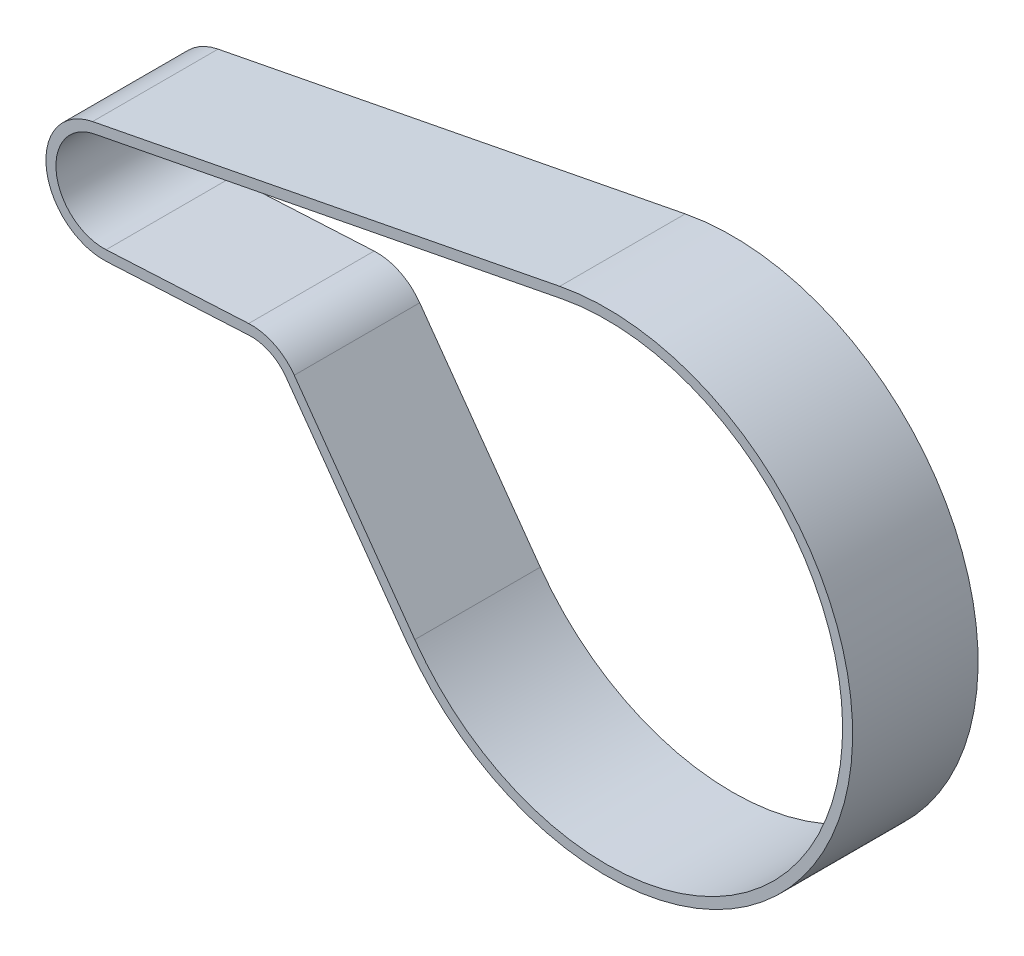
ISO-10303-21;
HEADER;
FILE_DESCRIPTION(('STEP AP214'),'2;1');
FILE_NAME('part.step','',(''),(''),'','','');
FILE_SCHEMA(('AUTOMOTIVE_DESIGN { 1 0 10303 214 1 1 1 1 }'));
ENDSEC;
DATA;
#1=APPLICATION_CONTEXT('core data for automotive mechanical design processes');
#2=APPLICATION_PROTOCOL_DEFINITION('international standard','automotive_design',2000,#1);
#3=PRODUCT_CONTEXT('',#1,'mechanical');
#4=PRODUCT('Part','Part','',(#3));
#5=PRODUCT_RELATED_PRODUCT_CATEGORY('part','',(#4));
#6=PRODUCT_DEFINITION_FORMATION('','',#4);
#7=PRODUCT_DEFINITION_CONTEXT('part definition',#1,'design');
#8=PRODUCT_DEFINITION('design','',#6,#7);
#9=PRODUCT_DEFINITION_SHAPE('','',#8);
#10=(LENGTH_UNIT() NAMED_UNIT(*) SI_UNIT(.MILLI.,.METRE.));
#11=(NAMED_UNIT(*) PLANE_ANGLE_UNIT() SI_UNIT($,.RADIAN.));
#12=(NAMED_UNIT(*) SI_UNIT($,.STERADIAN.) SOLID_ANGLE_UNIT());
#13=UNCERTAINTY_MEASURE_WITH_UNIT(LENGTH_MEASURE(1.E-05),#10,'distance_accuracy_value','');
#14=(GEOMETRIC_REPRESENTATION_CONTEXT(3) GLOBAL_UNCERTAINTY_ASSIGNED_CONTEXT((#13)) GLOBAL_UNIT_ASSIGNED_CONTEXT((#10,
#11,#12)) REPRESENTATION_CONTEXT('',''));
#15=CARTESIAN_POINT('',(0.,0.,0.));
#16=DIRECTION('',(0.,0.,1.));
#17=DIRECTION('',(1.,0.,0.));
#18=AXIS2_PLACEMENT_3D('',#15,#16,#17);
#19=CARTESIAN_POINT('',(-8.75410854916936E-11,-1.35003119794419E-10,-9.5));
#20=DIRECTION('',(0.,0.,1.));
#21=DIRECTION('',(1.,0.,0.));
#22=AXIS2_PLACEMENT_3D('',#19,#20,#21);
#23=CYLINDRICAL_SURFACE('',#22,11.5);
#24=DIRECTION('',(0.,0.,1.));
#25=VECTOR('',#24,1.);
#26=CARTESIAN_POINT('',(0.595527740548142,-11.4845699402822,-9.5));
#27=LINE('',#26,#25);
#28=CARTESIAN_POINT('',(0.595527740548142,-11.4845699402822,-9.5));
#29=VERTEX_POINT('',#28);
#30=CARTESIAN_POINT('',(0.595527740548142,-11.4845699402822,15.5));
#31=VERTEX_POINT('',#30);
#32=EDGE_CURVE('E108',#29,#31,#27,.T.);
#33=ORIENTED_EDGE('',*,*,#32,.T.);
#34=CARTESIAN_POINT('',(-8.75410854916936E-11,-1.35003119794419E-10,15.5));
#35=DIRECTION('',(0.,0.,-1.));
#36=DIRECTION('',(-1.,0.,0.));
#37=AXIS2_PLACEMENT_3D('',#34,#35,#36);
#38=CIRCLE('',#37,11.5);
#39=CARTESIAN_POINT('',(-2.19608532579702,11.2883661013964,15.5));
#40=VERTEX_POINT('',#39);
#41=EDGE_CURVE('E231',#40,#31,#38,.F.);
#42=ORIENTED_EDGE('',*,*,#41,.F.);
#43=DIRECTION('',(0.,0.,1.));
#44=VECTOR('',#43,1.);
#45=CARTESIAN_POINT('',(-2.19608532579702,11.2883661013964,-9.5));
#46=LINE('',#45,#44);
#47=CARTESIAN_POINT('',(-2.19608532579702,11.2883661013964,-9.5));
#48=VERTEX_POINT('',#47);
#49=EDGE_CURVE('E12',#48,#40,#46,.T.);
#50=ORIENTED_EDGE('',*,*,#49,.F.);
#51=CARTESIAN_POINT('',(-8.75410854916936E-11,-1.35003119794419E-10,-9.5));
#52=DIRECTION('',(0.,0.,-1.));
#53=DIRECTION('',(-1.,0.,0.));
#54=AXIS2_PLACEMENT_3D('',#51,#52,#53);
#55=CIRCLE('',#54,11.5);
#56=EDGE_CURVE('E262',#48,#29,#55,.F.);
#57=ORIENTED_EDGE('',*,*,#56,.T.);
#58=EDGE_LOOP('',(#33,#42,#50,#57));
#59=FACE_BOUND('',#58,.T.);
#60=ADVANCED_FACE('F105',(#59),#23,.T.);
#61=CARTESIAN_POINT('',(-2.19608532579702,11.2883661013964,-9.5));
#62=DIRECTION('',(-0.190963941366042,0.981597052307079,0.));
#63=DIRECTION('',(-0.981597052307079,-0.190963941366042,0.));
#64=AXIS2_PLACEMENT_3D('',#61,#62,#63);
#65=PLANE('',#64);
#66=ORIENTED_EDGE('',*,*,#49,.T.);
#67=DIRECTION('',(-0.981597052307079,-0.190963941366042,0.));
#68=VECTOR('',#67,1.);
#69=CARTESIAN_POINT('',(-2.19608532579702,11.2883661013964,15.5));
#70=LINE('',#69,#68);
#71=CARTESIAN_POINT('',(90.8927668730152,29.3982555630091,15.5));
#72=VERTEX_POINT('',#71);
#73=EDGE_CURVE('E246',#72,#40,#70,.T.);
#74=ORIENTED_EDGE('',*,*,#73,.F.);
#75=DIRECTION('',(0.,0.,1.));
#76=VECTOR('',#75,1.);
#77=CARTESIAN_POINT('',(90.8927668730152,29.3982555630091,-9.5));
#78=LINE('',#77,#76);
#79=CARTESIAN_POINT('',(90.8927668730152,29.3982555630091,-9.5));
#80=VERTEX_POINT('',#79);
#81=EDGE_CURVE('E113',#80,#72,#78,.T.);
#82=ORIENTED_EDGE('',*,*,#81,.F.);
#83=DIRECTION('',(-0.981597052307079,-0.190963941366042,0.));
#84=VECTOR('',#83,1.);
#85=CARTESIAN_POINT('',(-2.19608532579702,11.2883661013964,-9.5));
#86=LINE('',#85,#84);
#87=EDGE_CURVE('E283',#80,#48,#86,.T.);
#88=ORIENTED_EDGE('',*,*,#87,.T.);
#89=EDGE_LOOP('',(#66,#74,#82,#88));
#90=FACE_BOUND('',#89,.T.);
#91=ADVANCED_FACE('F300',(#90),#65,.T.);
#92=CARTESIAN_POINT('',(100.249999999951,-18.7000000000378,-9.5));
#93=DIRECTION('',(0.,0.,1.));
#94=DIRECTION('',(1.,0.,0.));
#95=AXIS2_PLACEMENT_3D('',#92,#93,#94);
#96=CYLINDRICAL_SURFACE('',#95,49.);
#97=ORIENTED_EDGE('',*,*,#81,.T.);
#98=CARTESIAN_POINT('',(100.249999999951,-18.7000000000378,15.5));
#99=DIRECTION('',(0.,0.,-1.));
#100=DIRECTION('',(-1.,0.,0.));
#101=AXIS2_PLACEMENT_3D('',#98,#99,#100);
#102=CIRCLE('',#101,49.);
#103=CARTESIAN_POINT('',(60.3770303060087,-47.1806300454904,15.5));
#104=VERTEX_POINT('',#103);
#105=EDGE_CURVE('E243',#104,#72,#102,.F.);
#106=ORIENTED_EDGE('',*,*,#105,.F.);
#107=DIRECTION('',(0.,0.,1.));
#108=VECTOR('',#107,1.);
#109=CARTESIAN_POINT('',(60.3770303060087,-47.1806300454904,-9.5));
#110=LINE('',#109,#108);
#111=CARTESIAN_POINT('',(60.3770303060087,-47.1806300454904,-9.5));
#112=VERTEX_POINT('',#111);
#113=EDGE_CURVE('E287',#112,#104,#110,.T.);
#114=ORIENTED_EDGE('',*,*,#113,.F.);
#115=CARTESIAN_POINT('',(100.249999999951,-18.7000000000378,-9.5));
#116=DIRECTION('',(0.,0.,-1.));
#117=DIRECTION('',(-1.,0.,0.));
#118=AXIS2_PLACEMENT_3D('',#115,#116,#117);
#119=CIRCLE('',#118,49.);
#120=EDGE_CURVE('E280',#112,#80,#119,.F.);
#121=ORIENTED_EDGE('',*,*,#120,.T.);
#122=EDGE_LOOP('',(#97,#106,#114,#121));
#123=FACE_BOUND('',#122,.T.);
#124=ADVANCED_FACE('F313',(#123),#96,.T.);
#125=CARTESIAN_POINT('',(17.6642973466046,12.6173275178712,-9.5));
#126=DIRECTION('',(-0.813734075386583,-0.58123734786638,0.));
#127=DIRECTION('',(0.58123734786638,-0.813734075386583,0.));
#128=AXIS2_PLACEMENT_3D('',#125,#126,#127);
#129=PLANE('',#128);
#130=ORIENTED_EDGE('',*,*,#113,.T.);
#131=DIRECTION('',(0.58123734786638,-0.813734075386583,0.));
#132=VECTOR('',#131,1.);
#133=CARTESIAN_POINT('',(17.6642973466046,12.6173275178712,15.5));
#134=LINE('',#133,#132);
#135=CARTESIAN_POINT('',(36.3619777260362,-13.5594825430823,15.5));
#136=VERTEX_POINT('',#135);
#137=EDGE_CURVE('E240',#136,#104,#134,.T.);
#138=ORIENTED_EDGE('',*,*,#137,.F.);
#139=DIRECTION('',(0.,0.,1.));
#140=VECTOR('',#139,1.);
#141=CARTESIAN_POINT('',(36.3619777260362,-13.5594825430823,-9.5));
#142=LINE('',#141,#140);
#143=CARTESIAN_POINT('',(36.3619777260362,-13.5594825430823,-9.5));
#144=VERTEX_POINT('',#143);
#145=EDGE_CURVE('E289',#144,#136,#142,.T.);
#146=ORIENTED_EDGE('',*,*,#145,.F.);
#147=DIRECTION('',(0.58123734786638,-0.813734075386583,0.));
#148=VECTOR('',#147,1.);
#149=CARTESIAN_POINT('',(17.6642973466046,12.6173275178712,-9.5));
#150=LINE('',#149,#148);
#151=EDGE_CURVE('E277',#144,#112,#150,.T.);
#152=ORIENTED_EDGE('',*,*,#151,.T.);
#153=EDGE_LOOP('',(#130,#138,#146,#152));
#154=FACE_BOUND('',#153,.T.);
#155=ADVANCED_FACE('F311',(#154),#129,.T.);
#156=CARTESIAN_POINT('',(29.4452380852502,-18.4999999999465,-9.5));
#157=DIRECTION('',(0.,0.,1.));
#158=DIRECTION('',(1.,0.,0.));
#159=AXIS2_PLACEMENT_3D('',#156,#157,#158);
#160=CYLINDRICAL_SURFACE('',#159,8.5);
#161=ORIENTED_EDGE('',*,*,#145,.T.);
#162=CARTESIAN_POINT('',(29.4452380852502,-18.4999999999465,15.5));
#163=DIRECTION('',(0.,0.,-1.));
#164=DIRECTION('',(-1.,0.,0.));
#165=AXIS2_PLACEMENT_3D('',#162,#163,#164);
#166=CIRCLE('',#165,8.5);
#167=CARTESIAN_POINT('',(29.0050654073891,-10.0114048267942,15.5));
#168=VERTEX_POINT('',#167);
#169=EDGE_CURVE('E237',#168,#136,#166,.T.);
#170=ORIENTED_EDGE('',*,*,#169,.F.);
#171=DIRECTION('',(0.,0.,1.));
#172=VECTOR('',#171,1.);
#173=CARTESIAN_POINT('',(29.0050654073891,-10.0114048267942,-9.5));
#174=LINE('',#173,#172);
#175=CARTESIAN_POINT('',(29.0050654073891,-10.0114048267942,-9.5));
#176=VERTEX_POINT('',#175);
#177=EDGE_CURVE('E290',#176,#168,#174,.T.);
#178=ORIENTED_EDGE('',*,*,#177,.F.);
#179=CARTESIAN_POINT('',(29.4452380852502,-18.4999999999465,-9.5));
#180=DIRECTION('',(0.,0.,-1.));
#181=DIRECTION('',(-1.,0.,0.));
#182=AXIS2_PLACEMENT_3D('',#179,#180,#181);
#183=CIRCLE('',#182,8.5);
#184=EDGE_CURVE('E274',#176,#144,#183,.T.);
#185=ORIENTED_EDGE('',*,*,#184,.T.);
#186=EDGE_LOOP('',(#161,#170,#178,#185));
#187=FACE_BOUND('',#186,.T.);
#188=ADVANCED_FACE('F308',(#187),#160,.F.);
#189=CARTESIAN_POINT('',(0.595527740548146,-11.4845699402822,-9.5));
#190=DIRECTION('',(0.0517850209248424,-0.998658255664977,0.));
#191=DIRECTION('',(0.998658255664977,0.0517850209248424,0.));
#192=AXIS2_PLACEMENT_3D('',#189,#190,#191);
#193=PLANE('',#192);
#194=ORIENTED_EDGE('',*,*,#177,.T.);
#195=DIRECTION('',(0.998658255664977,0.0517850209248424,0.));
#196=VECTOR('',#195,1.);
#197=CARTESIAN_POINT('',(0.595527740548146,-11.4845699402822,15.5));
#198=LINE('',#197,#196);
#199=EDGE_CURVE('E234',#31,#168,#198,.T.);
#200=ORIENTED_EDGE('',*,*,#199,.F.);
#201=ORIENTED_EDGE('',*,*,#32,.F.);
#202=DIRECTION('',(0.998658255664977,0.0517850209248424,0.));
#203=VECTOR('',#202,1.);
#204=CARTESIAN_POINT('',(0.595527740548146,-11.4845699402822,-9.5));
#205=LINE('',#204,#203);
#206=EDGE_CURVE('E271',#29,#176,#205,.T.);
#207=ORIENTED_EDGE('',*,*,#206,.T.);
#208=EDGE_LOOP('',(#194,#200,#201,#207));
#209=FACE_BOUND('',#208,.T.);
#210=ADVANCED_FACE('F294',(#209),#193,.T.);
#211=CARTESIAN_POINT('',(-8.75410854916936E-11,-1.35003119794419E-10,-9.5));
#212=DIRECTION('',(0.,0.,-1.));
#213=DIRECTION('',(-1.,0.,0.));
#214=AXIS2_PLACEMENT_3D('',#211,#212,#213);
#215=PLANE('',#214);
#216=CARTESIAN_POINT('',(-8.75410854916936E-11,-1.35003119794419E-10,-9.5));
#217=DIRECTION('',(0.,0.,1.));
#218=DIRECTION('',(-1.,0.,0.));
#219=AXIS2_PLACEMENT_3D('',#216,#217,#218);
#220=CIRCLE('',#219,9.5);
#221=CARTESIAN_POINT('',(-1.81415744306493,9.32517199678225,-9.5));
#222=VERTEX_POINT('',#221);
#223=CARTESIAN_POINT('',(0.49195769869846,-9.48725342895228,-9.5));
#224=VERTEX_POINT('',#223);
#225=EDGE_CURVE('E249',#222,#224,#220,.T.);
#226=ORIENTED_EDGE('',*,*,#225,.T.);
#227=DIRECTION('',(0.998658255664976,0.0517850209248424,0.));
#228=VECTOR('',#227,1.);
#229=CARTESIAN_POINT('',(28.9014953655394,-8.01408831546425,-9.5));
#230=LINE('',#229,#228);
#231=CARTESIAN_POINT('',(28.9014953655394,-8.01408831546425,-9.5));
#232=VERTEX_POINT('',#231);
#233=EDGE_CURVE('E201',#224,#232,#230,.T.);
#234=ORIENTED_EDGE('',*,*,#233,.T.);
#235=CARTESIAN_POINT('',(29.4452380852502,-18.4999999999465,-9.5));
#236=DIRECTION('',(0.,0.,-1.));
#237=DIRECTION('',(1.,0.,0.));
#238=AXIS2_PLACEMENT_3D('',#235,#236,#237);
#239=CIRCLE('',#238,10.5);
#240=CARTESIAN_POINT('',(37.9894458768094,-12.3970078473495,-9.5));
#241=VERTEX_POINT('',#240);
#242=EDGE_CURVE('E121',#232,#241,#239,.T.);
#243=ORIENTED_EDGE('',*,*,#242,.T.);
#244=DIRECTION('',(0.58123734786638,-0.813734075386583,0.));
#245=VECTOR('',#244,1.);
#246=CARTESIAN_POINT('',(62.0044984567818,-46.0181553497576,-9.5));
#247=LINE('',#246,#245);
#248=CARTESIAN_POINT('',(62.0044984567818,-46.0181553497576,-9.5));
#249=VERTEX_POINT('',#248);
#250=EDGE_CURVE('E253',#241,#249,#247,.T.);
#251=ORIENTED_EDGE('',*,*,#250,.T.);
#252=CARTESIAN_POINT('',(100.249999999951,-18.7000000000378,-9.5));
#253=DIRECTION('',(0.,0.,1.));
#254=DIRECTION('',(-1.,0.,0.));
#255=AXIS2_PLACEMENT_3D('',#252,#253,#254);
#256=CIRCLE('',#255,47.);
#257=CARTESIAN_POINT('',(91.2746947557473,27.435061458395,-9.5));
#258=VERTEX_POINT('',#257);
#259=EDGE_CURVE('E256',#249,#258,#256,.T.);
#260=ORIENTED_EDGE('',*,*,#259,.T.);
#261=DIRECTION('',(-0.981597052307079,-0.190963941366042,0.));
#262=VECTOR('',#261,1.);
#263=CARTESIAN_POINT('',(-1.81415744306493,9.32517199678225,-9.5));
#264=LINE('',#263,#262);
#265=EDGE_CURVE('E206',#258,#222,#264,.T.);
#266=ORIENTED_EDGE('',*,*,#265,.T.);
#267=EDGE_LOOP('',(#226,#234,#243,#251,#260,#266));
#268=FACE_BOUND('',#267,.T.);
#269=ORIENTED_EDGE('',*,*,#56,.F.);
#270=ORIENTED_EDGE('',*,*,#87,.F.);
#271=ORIENTED_EDGE('',*,*,#120,.F.);
#272=ORIENTED_EDGE('',*,*,#151,.F.);
#273=ORIENTED_EDGE('',*,*,#184,.F.);
#274=ORIENTED_EDGE('',*,*,#206,.F.);
#275=EDGE_LOOP('',(#269,#270,#271,#272,#273,#274));
#276=FACE_BOUND('',#275,.T.);
#277=ADVANCED_FACE('F304',(#268,#276),#215,.T.);
#278=CARTESIAN_POINT('',(-8.75410854916936E-11,-1.35003119794419E-10,-9.5));
#279=DIRECTION('',(0.,0.,1.));
#280=DIRECTION('',(1.,0.,0.));
#281=AXIS2_PLACEMENT_3D('',#278,#279,#280);
#282=CYLINDRICAL_SURFACE('',#281,9.5);
#283=DIRECTION('',(0.,0.,1.));
#284=VECTOR('',#283,1.);
#285=CARTESIAN_POINT('',(-1.81415744306493,9.32517199678225,-9.5));
#286=LINE('',#285,#284);
#287=CARTESIAN_POINT('',(-1.81415744306493,9.32517199678225,15.5));
#288=VERTEX_POINT('',#287);
#289=EDGE_CURVE('E211',#222,#288,#286,.T.);
#290=ORIENTED_EDGE('',*,*,#289,.T.);
#291=CARTESIAN_POINT('',(-8.75410854916936E-11,-1.35003119794419E-10,15.5));
#292=DIRECTION('',(0.,0.,1.));
#293=DIRECTION('',(-1.,0.,0.));
#294=AXIS2_PLACEMENT_3D('',#291,#292,#293);
#295=CIRCLE('',#294,9.5);
#296=CARTESIAN_POINT('',(0.49195769869846,-9.48725342895228,15.5));
#297=VERTEX_POINT('',#296);
#298=EDGE_CURVE('E209',#288,#297,#295,.T.);
#299=ORIENTED_EDGE('',*,*,#298,.T.);
#300=DIRECTION('',(0.,0.,1.));
#301=VECTOR('',#300,1.);
#302=CARTESIAN_POINT('',(0.49195769869846,-9.48725342895228,-9.5));
#303=LINE('',#302,#301);
#304=EDGE_CURVE('E194',#224,#297,#303,.T.);
#305=ORIENTED_EDGE('',*,*,#304,.F.);
#306=ORIENTED_EDGE('',*,*,#225,.F.);
#307=EDGE_LOOP('',(#290,#299,#305,#306));
#308=FACE_BOUND('',#307,.T.);
#309=ADVANCED_FACE('F210',(#308),#282,.F.);
#310=CARTESIAN_POINT('',(-1.81415744306493,9.32517199678225,-9.5));
#311=DIRECTION('',(-0.190963941366042,0.981597052307079,0.));
#312=DIRECTION('',(-0.981597052307079,-0.190963941366042,0.));
#313=AXIS2_PLACEMENT_3D('',#310,#311,#312);
#314=PLANE('',#313);
#315=DIRECTION('',(0.,0.,1.));
#316=VECTOR('',#315,1.);
#317=CARTESIAN_POINT('',(91.2746947557473,27.435061458395,-9.5));
#318=LINE('',#317,#316);
#319=CARTESIAN_POINT('',(91.2746947557473,27.435061458395,15.5));
#320=VERTEX_POINT('',#319);
#321=EDGE_CURVE('E263',#258,#320,#318,.T.);
#322=ORIENTED_EDGE('',*,*,#321,.T.);
#323=DIRECTION('',(-0.981597052307079,-0.190963941366042,0.));
#324=VECTOR('',#323,1.);
#325=CARTESIAN_POINT('',(-1.81415744306493,9.32517199678225,15.5));
#326=LINE('',#325,#324);
#327=EDGE_CURVE('E229',#320,#288,#326,.T.);
#328=ORIENTED_EDGE('',*,*,#327,.T.);
#329=ORIENTED_EDGE('',*,*,#289,.F.);
#330=ORIENTED_EDGE('',*,*,#265,.F.);
#331=EDGE_LOOP('',(#322,#328,#329,#330));
#332=FACE_BOUND('',#331,.T.);
#333=ADVANCED_FACE('F372',(#332),#314,.F.);
#334=CARTESIAN_POINT('',(100.249999999951,-18.7000000000378,-9.5));
#335=DIRECTION('',(0.,0.,1.));
#336=DIRECTION('',(1.,0.,0.));
#337=AXIS2_PLACEMENT_3D('',#334,#335,#336);
#338=CYLINDRICAL_SURFACE('',#337,47.);
#339=DIRECTION('',(0.,0.,1.));
#340=VECTOR('',#339,1.);
#341=CARTESIAN_POINT('',(62.0044984567818,-46.0181553497576,-9.5));
#342=LINE('',#341,#340);
#343=CARTESIAN_POINT('',(62.0044984567818,-46.0181553497576,15.5));
#344=VERTEX_POINT('',#343);
#345=EDGE_CURVE('E265',#249,#344,#342,.T.);
#346=ORIENTED_EDGE('',*,*,#345,.T.);
#347=CARTESIAN_POINT('',(100.249999999951,-18.7000000000378,15.5));
#348=DIRECTION('',(0.,0.,1.));
#349=DIRECTION('',(-1.,0.,0.));
#350=AXIS2_PLACEMENT_3D('',#347,#348,#349);
#351=CIRCLE('',#350,47.);
#352=EDGE_CURVE('E226',#344,#320,#351,.T.);
#353=ORIENTED_EDGE('',*,*,#352,.T.);
#354=ORIENTED_EDGE('',*,*,#321,.F.);
#355=ORIENTED_EDGE('',*,*,#259,.F.);
#356=EDGE_LOOP('',(#346,#353,#354,#355));
#357=FACE_BOUND('',#356,.T.);
#358=ADVANCED_FACE('F381',(#357),#338,.F.);
#359=CARTESIAN_POINT('',(62.0044984567818,-46.0181553497576,-9.5));
#360=DIRECTION('',(-0.813734075386583,-0.58123734786638,0.));
#361=DIRECTION('',(0.58123734786638,-0.813734075386583,0.));
#362=AXIS2_PLACEMENT_3D('',#359,#360,#361);
#363=PLANE('',#362);
#364=DIRECTION('',(0.,0.,1.));
#365=VECTOR('',#364,1.);
#366=CARTESIAN_POINT('',(37.9894458768094,-12.3970078473495,-9.5));
#367=LINE('',#366,#365);
#368=CARTESIAN_POINT('',(37.9894458768094,-12.3970078473495,15.5));
#369=VERTEX_POINT('',#368);
#370=EDGE_CURVE('E267',#241,#369,#367,.T.);
#371=ORIENTED_EDGE('',*,*,#370,.T.);
#372=DIRECTION('',(0.58123734786638,-0.813734075386583,0.));
#373=VECTOR('',#372,1.);
#374=CARTESIAN_POINT('',(62.0044984567818,-46.0181553497576,15.5));
#375=LINE('',#374,#373);
#376=EDGE_CURVE('E221',#369,#344,#375,.T.);
#377=ORIENTED_EDGE('',*,*,#376,.T.);
#378=ORIENTED_EDGE('',*,*,#345,.F.);
#379=ORIENTED_EDGE('',*,*,#250,.F.);
#380=EDGE_LOOP('',(#371,#377,#378,#379));
#381=FACE_BOUND('',#380,.T.);
#382=ADVANCED_FACE('F391',(#381),#363,.F.);
#383=CARTESIAN_POINT('',(29.4452380852502,-18.4999999999465,-9.5));
#384=DIRECTION('',(0.,0.,1.));
#385=DIRECTION('',(1.,0.,0.));
#386=AXIS2_PLACEMENT_3D('',#383,#384,#385);
#387=CYLINDRICAL_SURFACE('',#386,10.5);
#388=DIRECTION('',(0.,0.,1.));
#389=VECTOR('',#388,1.);
#390=CARTESIAN_POINT('',(28.9014953655394,-8.01408831546425,-9.5));
#391=LINE('',#390,#389);
#392=CARTESIAN_POINT('',(28.9014953655394,-8.01408831546425,15.5));
#393=VERTEX_POINT('',#392);
#394=EDGE_CURVE('E205',#232,#393,#391,.T.);
#395=ORIENTED_EDGE('',*,*,#394,.T.);
#396=CARTESIAN_POINT('',(29.4452380852502,-18.4999999999465,15.5));
#397=DIRECTION('',(0.,0.,-1.));
#398=DIRECTION('',(1.,0.,0.));
#399=AXIS2_PLACEMENT_3D('',#396,#397,#398);
#400=CIRCLE('',#399,10.5);
#401=EDGE_CURVE('E219',#393,#369,#400,.T.);
#402=ORIENTED_EDGE('',*,*,#401,.T.);
#403=ORIENTED_EDGE('',*,*,#370,.F.);
#404=ORIENTED_EDGE('',*,*,#242,.F.);
#405=EDGE_LOOP('',(#395,#402,#403,#404));
#406=FACE_BOUND('',#405,.T.);
#407=ADVANCED_FACE('F401',(#406),#387,.T.);
#408=CARTESIAN_POINT('',(28.9014953655394,-8.01408831546425,-9.5));
#409=DIRECTION('',(0.0517850209248424,-0.998658255664976,0.));
#410=DIRECTION('',(0.998658255664977,0.0517850209248424,0.));
#411=AXIS2_PLACEMENT_3D('',#408,#409,#410);
#412=PLANE('',#411);
#413=ORIENTED_EDGE('',*,*,#304,.T.);
#414=DIRECTION('',(0.998658255664976,0.0517850209248424,0.));
#415=VECTOR('',#414,1.);
#416=CARTESIAN_POINT('',(28.9014953655394,-8.01408831546425,15.5));
#417=LINE('',#416,#415);
#418=EDGE_CURVE('E198',#297,#393,#417,.T.);
#419=ORIENTED_EDGE('',*,*,#418,.T.);
#420=ORIENTED_EDGE('',*,*,#394,.F.);
#421=ORIENTED_EDGE('',*,*,#233,.F.);
#422=EDGE_LOOP('',(#413,#419,#420,#421));
#423=FACE_BOUND('',#422,.T.);
#424=ADVANCED_FACE('F196',(#423),#412,.F.);
#425=CARTESIAN_POINT('',(-8.75410854916936E-11,-1.35003119794419E-10,15.5));
#426=DIRECTION('',(0.,0.,-1.));
#427=DIRECTION('',(-1.,0.,0.));
#428=AXIS2_PLACEMENT_3D('',#425,#426,#427);
#429=PLANE('',#428);
#430=ORIENTED_EDGE('',*,*,#41,.T.);
#431=ORIENTED_EDGE('',*,*,#199,.T.);
#432=ORIENTED_EDGE('',*,*,#169,.T.);
#433=ORIENTED_EDGE('',*,*,#137,.T.);
#434=ORIENTED_EDGE('',*,*,#105,.T.);
#435=ORIENTED_EDGE('',*,*,#73,.T.);
#436=EDGE_LOOP('',(#430,#431,#432,#433,#434,#435));
#437=FACE_BOUND('',#436,.T.);
#438=ORIENTED_EDGE('',*,*,#298,.F.);
#439=ORIENTED_EDGE('',*,*,#327,.F.);
#440=ORIENTED_EDGE('',*,*,#352,.F.);
#441=ORIENTED_EDGE('',*,*,#376,.F.);
#442=ORIENTED_EDGE('',*,*,#401,.F.);
#443=ORIENTED_EDGE('',*,*,#418,.F.);
#444=EDGE_LOOP('',(#438,#439,#440,#441,#442,#443));
#445=FACE_BOUND('',#444,.T.);
#446=ADVANCED_FACE('F216',(#437,#445),#429,.F.);
#447=CLOSED_SHELL('',(#60,#91,#124,#155,#188,#210,#277,#309,#333,#358,#382,#407,#424,#446));
#448=MANIFOLD_SOLID_BREP('B2',#447);
#449=ADVANCED_BREP_SHAPE_REPRESENTATION('',(#18,#448),#14);
#450=SHAPE_DEFINITION_REPRESENTATION(#9,#449);
ENDSEC;
END-ISO-10303-21;
